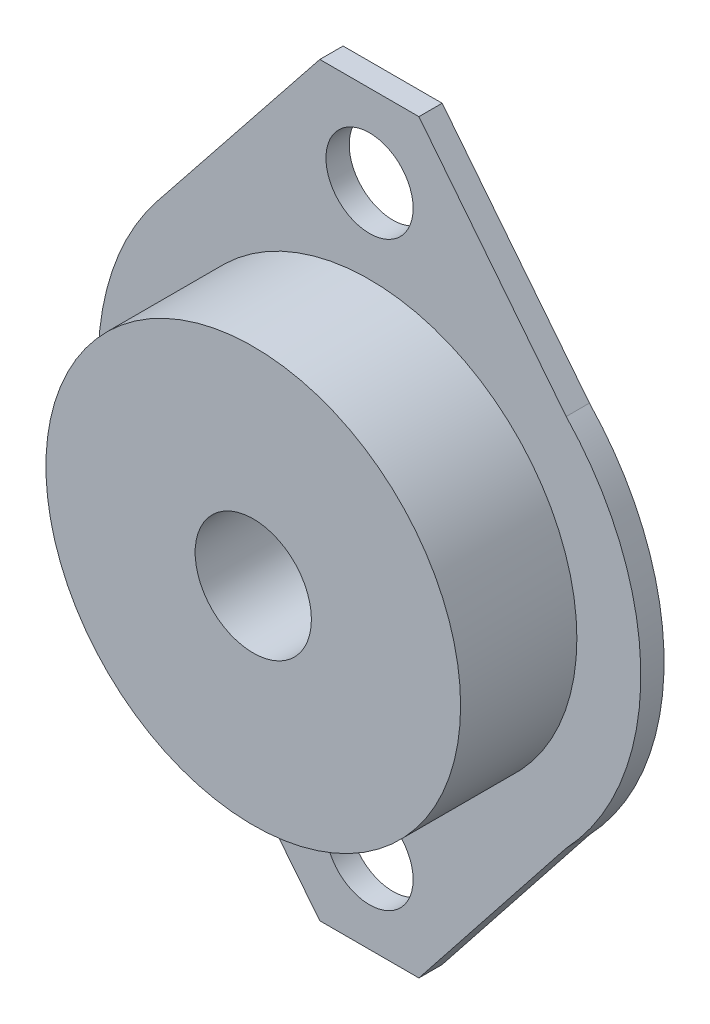
ISO-10303-21;
HEADER;
FILE_DESCRIPTION(('STEP AP214'),'2;1');
FILE_NAME('part.step','',(''),(''),'','','');
FILE_SCHEMA(('AUTOMOTIVE_DESIGN { 1 0 10303 214 1 1 1 1 }'));
ENDSEC;
DATA;
#1=APPLICATION_CONTEXT('core data for automotive mechanical design processes');
#2=APPLICATION_PROTOCOL_DEFINITION('international standard','automotive_design',2000,#1);
#3=PRODUCT_CONTEXT('',#1,'mechanical');
#4=PRODUCT('Part','Part','',(#3));
#5=PRODUCT_RELATED_PRODUCT_CATEGORY('part','',(#4));
#6=PRODUCT_DEFINITION_FORMATION('','',#4);
#7=PRODUCT_DEFINITION_CONTEXT('part definition',#1,'design');
#8=PRODUCT_DEFINITION('design','',#6,#7);
#9=PRODUCT_DEFINITION_SHAPE('','',#8);
#10=(LENGTH_UNIT() NAMED_UNIT(*) SI_UNIT(.MILLI.,.METRE.));
#11=(NAMED_UNIT(*) PLANE_ANGLE_UNIT() SI_UNIT($,.RADIAN.));
#12=(NAMED_UNIT(*) SI_UNIT($,.STERADIAN.) SOLID_ANGLE_UNIT());
#13=UNCERTAINTY_MEASURE_WITH_UNIT(LENGTH_MEASURE(1.E-05),#10,'distance_accuracy_value','');
#14=(GEOMETRIC_REPRESENTATION_CONTEXT(3) GLOBAL_UNCERTAINTY_ASSIGNED_CONTEXT((#13)) GLOBAL_UNIT_ASSIGNED_CONTEXT((#10,
#11,#12)) REPRESENTATION_CONTEXT('',''));
#15=CARTESIAN_POINT('',(0.,0.,0.));
#16=DIRECTION('',(0.,0.,1.));
#17=DIRECTION('',(1.,0.,0.));
#18=AXIS2_PLACEMENT_3D('',#15,#16,#17);
#19=CARTESIAN_POINT('',(0.,0.,1.2));
#20=DIRECTION('',(0.,0.,1.));
#21=DIRECTION('',(1.,0.,0.));
#22=AXIS2_PLACEMENT_3D('',#19,#20,#21);
#23=PLANE('',#22);
#24=DIRECTION('',(1.,0.,0.));
#25=VECTOR('',#24,1.);
#26=CARTESIAN_POINT('',(-2.56503617783972,19.2470625598085,1.2));
#27=LINE('',#26,#25);
#28=CARTESIAN_POINT('',(-2.56503617783972,19.2470625598085,1.2));
#29=VERTEX_POINT('',#28);
#30=CARTESIAN_POINT('',(2.54796509267495,19.2470625598085,1.2));
#31=VERTEX_POINT('',#30);
#32=EDGE_CURVE('E106',#29,#31,#27,.T.);
#33=ORIENTED_EDGE('',*,*,#32,.F.);
#34=DIRECTION('',(-0.623154194367181,-0.782099002711671,0.));
#35=VECTOR('',#34,1.);
#36=CARTESIAN_POINT('',(-10.9493860379634,8.72415872114053,1.2));
#37=LINE('',#36,#35);
#38=CARTESIAN_POINT('',(-10.9493860379634,8.72415872114053,1.2));
#39=VERTEX_POINT('',#38);
#40=EDGE_CURVE('E117',#29,#39,#37,.T.);
#41=ORIENTED_EDGE('',*,*,#40,.T.);
#42=CARTESIAN_POINT('',(0.,0.,1.2));
#43=DIRECTION('',(0.,0.,1.));
#44=DIRECTION('',(1.,0.,0.));
#45=AXIS2_PLACEMENT_3D('',#42,#43,#44);
#46=CIRCLE('',#45,14.);
#47=CARTESIAN_POINT('',(-10.9493860379634,-8.72415872114052,1.2));
#48=VERTEX_POINT('',#47);
#49=EDGE_CURVE('E160',#39,#48,#46,.T.);
#50=ORIENTED_EDGE('',*,*,#49,.T.);
#51=DIRECTION('',(0.62315419436718,-0.782099002711671,0.));
#52=VECTOR('',#51,1.);
#53=CARTESIAN_POINT('',(-10.9493860379634,-8.72415872114052,1.2));
#54=LINE('',#53,#52);
#55=CARTESIAN_POINT('',(-2.56503617783972,-19.2470625598085,1.2));
#56=VERTEX_POINT('',#55);
#57=EDGE_CURVE('E176',#48,#56,#54,.T.);
#58=ORIENTED_EDGE('',*,*,#57,.T.);
#59=DIRECTION('',(-1.,0.,0.));
#60=VECTOR('',#59,1.);
#61=CARTESIAN_POINT('',(-2.56503617783972,-19.2470625598085,1.2));
#62=LINE('',#61,#60);
#63=CARTESIAN_POINT('',(2.54796509267495,-19.2470625598085,1.2));
#64=VERTEX_POINT('',#63);
#65=EDGE_CURVE('E123',#64,#56,#62,.T.);
#66=ORIENTED_EDGE('',*,*,#65,.F.);
#67=DIRECTION('',(0.620607537412347,0.784121345524392,0.));
#68=VECTOR('',#67,1.);
#69=CARTESIAN_POINT('',(0.,-22.4663496234943,1.2));
#70=LINE('',#69,#68);
#71=CARTESIAN_POINT('',(10.148136547858,-9.6444452720739,1.2));
#72=VERTEX_POINT('',#71);
#73=EDGE_CURVE('E225',#64,#72,#70,.T.);
#74=ORIENTED_EDGE('',*,*,#73,.T.);
#75=CARTESIAN_POINT('',(0.,0.,1.2));
#76=DIRECTION('',(0.,0.,1.));
#77=DIRECTION('',(1.,0.,0.));
#78=AXIS2_PLACEMENT_3D('',#75,#76,#77);
#79=CIRCLE('',#78,14.);
#80=CARTESIAN_POINT('',(10.148136547858,9.6444452720739,1.2));
#81=VERTEX_POINT('',#80);
#82=EDGE_CURVE('E135',#72,#81,#79,.T.);
#83=ORIENTED_EDGE('',*,*,#82,.T.);
#84=DIRECTION('',(-0.620607537412347,0.784121345524391,0.));
#85=VECTOR('',#84,1.);
#86=CARTESIAN_POINT('',(0.,22.4663496234943,1.2));
#87=LINE('',#86,#85);
#88=EDGE_CURVE('E120',#81,#31,#87,.T.);
#89=ORIENTED_EDGE('',*,*,#88,.T.);
#90=EDGE_LOOP('',(#33,#41,#50,#58,#66,#74,#83,#89));
#91=FACE_BOUND('',#90,.T.);
#92=CARTESIAN_POINT('',(0.,-15.,1.2));
#93=DIRECTION('',(0.,0.,1.));
#94=DIRECTION('',(1.,0.,0.));
#95=AXIS2_PLACEMENT_3D('',#92,#93,#94);
#96=CIRCLE('',#95,2.25);
#97=CARTESIAN_POINT('',(2.25,-15.,1.2));
#98=VERTEX_POINT('',#97);
#99=EDGE_CURVE('E203',#98,#98,#96,.T.);
#100=ORIENTED_EDGE('',*,*,#99,.F.);
#101=EDGE_LOOP('',(#100));
#102=FACE_BOUND('',#101,.T.);
#103=CARTESIAN_POINT('',(0.,15.,1.2));
#104=DIRECTION('',(0.,0.,1.));
#105=DIRECTION('',(1.,0.,0.));
#106=AXIS2_PLACEMENT_3D('',#103,#104,#105);
#107=CIRCLE('',#106,2.25);
#108=CARTESIAN_POINT('',(2.25,15.,1.2));
#109=VERTEX_POINT('',#108);
#110=EDGE_CURVE('E211',#109,#109,#107,.T.);
#111=ORIENTED_EDGE('',*,*,#110,.F.);
#112=EDGE_LOOP('',(#111));
#113=FACE_BOUND('',#112,.T.);
#114=CARTESIAN_POINT('',(0.,0.,1.2));
#115=DIRECTION('',(0.,0.,1.));
#116=DIRECTION('',(1.,0.,0.));
#117=AXIS2_PLACEMENT_3D('',#114,#115,#116);
#118=CIRCLE('',#117,10.7);
#119=CARTESIAN_POINT('',(10.7,0.,1.2));
#120=VERTEX_POINT('',#119);
#121=EDGE_CURVE('E190',#120,#120,#118,.T.);
#122=ORIENTED_EDGE('',*,*,#121,.F.);
#123=EDGE_LOOP('',(#122));
#124=FACE_BOUND('',#123,.T.);
#125=ADVANCED_FACE('F42',(#91,#102,#113,#124),#23,.T.);
#126=CARTESIAN_POINT('',(0.,0.,0.));
#127=DIRECTION('',(0.,0.,1.));
#128=DIRECTION('',(1.,0.,0.));
#129=AXIS2_PLACEMENT_3D('',#126,#127,#128);
#130=PLANE('',#129);
#131=DIRECTION('',(-0.623154194367181,-0.782099002711671,0.));
#132=VECTOR('',#131,1.);
#133=CARTESIAN_POINT('',(-10.9493860379634,8.72415872114053,0.));
#134=LINE('',#133,#132);
#135=CARTESIAN_POINT('',(-2.56503617783973,19.2470625598085,0.));
#136=VERTEX_POINT('',#135);
#137=CARTESIAN_POINT('',(-10.9493860379634,8.72415872114053,0.));
#138=VERTEX_POINT('',#137);
#139=EDGE_CURVE('E158',#136,#138,#134,.T.);
#140=ORIENTED_EDGE('',*,*,#139,.F.);
#141=DIRECTION('',(1.,0.,0.));
#142=VECTOR('',#141,1.);
#143=CARTESIAN_POINT('',(0.,19.2470625598085,0.));
#144=LINE('',#143,#142);
#145=CARTESIAN_POINT('',(2.54796509267495,19.2470625598085,0.));
#146=VERTEX_POINT('',#145);
#147=EDGE_CURVE('E65',#136,#146,#144,.T.);
#148=ORIENTED_EDGE('',*,*,#147,.T.);
#149=DIRECTION('',(-0.620607537412347,0.784121345524391,0.));
#150=VECTOR('',#149,1.);
#151=CARTESIAN_POINT('',(0.,22.4663496234943,0.));
#152=LINE('',#151,#150);
#153=CARTESIAN_POINT('',(10.148136547858,9.6444452720739,0.));
#154=VERTEX_POINT('',#153);
#155=EDGE_CURVE('E154',#154,#146,#152,.T.);
#156=ORIENTED_EDGE('',*,*,#155,.F.);
#157=CARTESIAN_POINT('',(0.,0.,0.));
#158=DIRECTION('',(0.,0.,1.));
#159=DIRECTION('',(1.,0.,0.));
#160=AXIS2_PLACEMENT_3D('',#157,#158,#159);
#161=CIRCLE('',#160,14.);
#162=CARTESIAN_POINT('',(10.148136547858,-9.6444452720739,0.));
#163=VERTEX_POINT('',#162);
#164=EDGE_CURVE('E151',#163,#154,#161,.T.);
#165=ORIENTED_EDGE('',*,*,#164,.F.);
#166=DIRECTION('',(0.620607537412347,0.784121345524392,0.));
#167=VECTOR('',#166,1.);
#168=CARTESIAN_POINT('',(0.,-22.4663496234943,0.));
#169=LINE('',#168,#167);
#170=CARTESIAN_POINT('',(2.54796509267495,-19.2470625598085,0.));
#171=VERTEX_POINT('',#170);
#172=EDGE_CURVE('E148',#171,#163,#169,.T.);
#173=ORIENTED_EDGE('',*,*,#172,.F.);
#174=DIRECTION('',(-1.,0.,0.));
#175=VECTOR('',#174,1.);
#176=CARTESIAN_POINT('',(0.,-19.2470625598085,0.));
#177=LINE('',#176,#175);
#178=CARTESIAN_POINT('',(-2.56503617783972,-19.2470625598085,0.));
#179=VERTEX_POINT('',#178);
#180=EDGE_CURVE('E58',#171,#179,#177,.T.);
#181=ORIENTED_EDGE('',*,*,#180,.T.);
#182=DIRECTION('',(0.62315419436718,-0.782099002711671,0.));
#183=VECTOR('',#182,1.);
#184=CARTESIAN_POINT('',(-10.9493860379634,-8.72415872114052,0.));
#185=LINE('',#184,#183);
#186=CARTESIAN_POINT('',(-10.9493860379634,-8.72415872114052,0.));
#187=VERTEX_POINT('',#186);
#188=EDGE_CURVE('E143',#187,#179,#185,.T.);
#189=ORIENTED_EDGE('',*,*,#188,.F.);
#190=CARTESIAN_POINT('',(0.,0.,0.));
#191=DIRECTION('',(0.,0.,1.));
#192=DIRECTION('',(1.,0.,0.));
#193=AXIS2_PLACEMENT_3D('',#190,#191,#192);
#194=CIRCLE('',#193,14.);
#195=EDGE_CURVE('E139',#138,#187,#194,.T.);
#196=ORIENTED_EDGE('',*,*,#195,.F.);
#197=EDGE_LOOP('',(#140,#148,#156,#165,#173,#181,#189,#196));
#198=FACE_BOUND('',#197,.T.);
#199=CARTESIAN_POINT('',(0.,0.,0.));
#200=DIRECTION('',(0.,0.,1.));
#201=DIRECTION('',(1.,0.,0.));
#202=AXIS2_PLACEMENT_3D('',#199,#200,#201);
#203=CIRCLE('',#202,3.);
#204=CARTESIAN_POINT('',(3.,0.,0.));
#205=VERTEX_POINT('',#204);
#206=EDGE_CURVE('E144',#205,#205,#203,.T.);
#207=ORIENTED_EDGE('',*,*,#206,.T.);
#208=EDGE_LOOP('',(#207));
#209=FACE_BOUND('',#208,.T.);
#210=CARTESIAN_POINT('',(0.,15.,0.));
#211=DIRECTION('',(0.,0.,1.));
#212=DIRECTION('',(1.,0.,0.));
#213=AXIS2_PLACEMENT_3D('',#210,#211,#212);
#214=CIRCLE('',#213,2.25);
#215=CARTESIAN_POINT('',(2.25,15.,0.));
#216=VERTEX_POINT('',#215);
#217=EDGE_CURVE('E207',#216,#216,#214,.T.);
#218=ORIENTED_EDGE('',*,*,#217,.T.);
#219=EDGE_LOOP('',(#218));
#220=FACE_BOUND('',#219,.T.);
#221=CARTESIAN_POINT('',(0.,-15.,0.));
#222=DIRECTION('',(0.,0.,1.));
#223=DIRECTION('',(1.,0.,0.));
#224=AXIS2_PLACEMENT_3D('',#221,#222,#223);
#225=CIRCLE('',#224,2.25);
#226=CARTESIAN_POINT('',(2.25,-15.,0.));
#227=VERTEX_POINT('',#226);
#228=EDGE_CURVE('E199',#227,#227,#225,.T.);
#229=ORIENTED_EDGE('',*,*,#228,.T.);
#230=EDGE_LOOP('',(#229));
#231=FACE_BOUND('',#230,.T.);
#232=ADVANCED_FACE('F180',(#198,#209,#220,#231),#130,.F.);
#233=CARTESIAN_POINT('',(0.,0.,1.2));
#234=DIRECTION('',(0.,0.,-1.));
#235=DIRECTION('',(-1.,0.,0.));
#236=AXIS2_PLACEMENT_3D('',#233,#234,#235);
#237=CYLINDRICAL_SURFACE('',#236,14.);
#238=ORIENTED_EDGE('',*,*,#195,.T.);
#239=DIRECTION('',(0.,0.,-1.));
#240=VECTOR('',#239,1.);
#241=CARTESIAN_POINT('',(-10.9493860379634,-8.72415872114052,1.2));
#242=LINE('',#241,#240);
#243=EDGE_CURVE('E112',#48,#187,#242,.T.);
#244=ORIENTED_EDGE('',*,*,#243,.F.);
#245=ORIENTED_EDGE('',*,*,#49,.F.);
#246=DIRECTION('',(0.,0.,-1.));
#247=VECTOR('',#246,1.);
#248=CARTESIAN_POINT('',(-10.9493860379634,8.72415872114053,1.2));
#249=LINE('',#248,#247);
#250=EDGE_CURVE('E127',#39,#138,#249,.T.);
#251=ORIENTED_EDGE('',*,*,#250,.T.);
#252=EDGE_LOOP('',(#238,#244,#245,#251));
#253=FACE_BOUND('',#252,.T.);
#254=ADVANCED_FACE('F44',(#253),#237,.T.);
#255=CARTESIAN_POINT('',(-10.9493860379634,-8.72415872114052,1.2));
#256=DIRECTION('',(0.782099002711671,0.62315419436718,0.));
#257=DIRECTION('',(-0.62315419436718,0.782099002711671,0.));
#258=AXIS2_PLACEMENT_3D('',#255,#256,#257);
#259=PLANE('',#258);
#260=ORIENTED_EDGE('',*,*,#188,.T.);
#261=DIRECTION('',(0.,0.,1.));
#262=VECTOR('',#261,1.);
#263=CARTESIAN_POINT('',(-2.56503617783972,-19.2470625598085,-4.8));
#264=LINE('',#263,#262);
#265=EDGE_CURVE('E241',#179,#56,#264,.T.);
#266=ORIENTED_EDGE('',*,*,#265,.T.);
#267=ORIENTED_EDGE('',*,*,#57,.F.);
#268=ORIENTED_EDGE('',*,*,#243,.T.);
#269=EDGE_LOOP('',(#260,#266,#267,#268));
#270=FACE_BOUND('',#269,.T.);
#271=ADVANCED_FACE('F173',(#270),#259,.F.);
#272=CARTESIAN_POINT('',(0.,-22.4663496234943,1.2));
#273=DIRECTION('',(-0.784121345524392,0.620607537412347,0.));
#274=DIRECTION('',(-0.620607537412347,-0.784121345524392,0.));
#275=AXIS2_PLACEMENT_3D('',#272,#273,#274);
#276=PLANE('',#275);
#277=ORIENTED_EDGE('',*,*,#73,.F.);
#278=DIRECTION('',(0.,0.,-1.));
#279=VECTOR('',#278,1.);
#280=CARTESIAN_POINT('',(2.54796509267495,-19.2470625598085,1.2));
#281=LINE('',#280,#279);
#282=EDGE_CURVE('E11',#64,#171,#281,.T.);
#283=ORIENTED_EDGE('',*,*,#282,.T.);
#284=ORIENTED_EDGE('',*,*,#172,.T.);
#285=DIRECTION('',(0.,0.,-1.));
#286=VECTOR('',#285,1.);
#287=CARTESIAN_POINT('',(10.148136547858,-9.6444452720739,1.2));
#288=LINE('',#287,#286);
#289=EDGE_CURVE('E165',#72,#163,#288,.T.);
#290=ORIENTED_EDGE('',*,*,#289,.F.);
#291=EDGE_LOOP('',(#277,#283,#284,#290));
#292=FACE_BOUND('',#291,.T.);
#293=ADVANCED_FACE('F246',(#292),#276,.F.);
#294=CARTESIAN_POINT('',(0.,0.,1.2));
#295=DIRECTION('',(0.,0.,-1.));
#296=DIRECTION('',(-1.,0.,0.));
#297=AXIS2_PLACEMENT_3D('',#294,#295,#296);
#298=CYLINDRICAL_SURFACE('',#297,14.);
#299=ORIENTED_EDGE('',*,*,#164,.T.);
#300=DIRECTION('',(0.,0.,-1.));
#301=VECTOR('',#300,1.);
#302=CARTESIAN_POINT('',(10.148136547858,9.6444452720739,1.2));
#303=LINE('',#302,#301);
#304=EDGE_CURVE('E133',#81,#154,#303,.T.);
#305=ORIENTED_EDGE('',*,*,#304,.F.);
#306=ORIENTED_EDGE('',*,*,#82,.F.);
#307=ORIENTED_EDGE('',*,*,#289,.T.);
#308=EDGE_LOOP('',(#299,#305,#306,#307));
#309=FACE_BOUND('',#308,.T.);
#310=ADVANCED_FACE('F234',(#309),#298,.T.);
#311=CARTESIAN_POINT('',(0.,22.4663496234943,1.2));
#312=DIRECTION('',(-0.784121345524391,-0.620607537412347,0.));
#313=DIRECTION('',(0.620607537412347,-0.784121345524391,0.));
#314=AXIS2_PLACEMENT_3D('',#311,#312,#313);
#315=PLANE('',#314);
#316=ORIENTED_EDGE('',*,*,#155,.T.);
#317=DIRECTION('',(0.,0.,1.));
#318=VECTOR('',#317,1.);
#319=CARTESIAN_POINT('',(2.54796509267495,19.2470625598085,-4.8));
#320=LINE('',#319,#318);
#321=EDGE_CURVE('E122',#146,#31,#320,.T.);
#322=ORIENTED_EDGE('',*,*,#321,.T.);
#323=ORIENTED_EDGE('',*,*,#88,.F.);
#324=ORIENTED_EDGE('',*,*,#304,.T.);
#325=EDGE_LOOP('',(#316,#322,#323,#324));
#326=FACE_BOUND('',#325,.T.);
#327=ADVANCED_FACE('F237',(#326),#315,.F.);
#328=CARTESIAN_POINT('',(-10.9493860379634,8.72415872114053,1.2));
#329=DIRECTION('',(0.782099002711671,-0.623154194367181,0.));
#330=DIRECTION('',(0.623154194367181,0.782099002711671,0.));
#331=AXIS2_PLACEMENT_3D('',#328,#329,#330);
#332=PLANE('',#331);
#333=ORIENTED_EDGE('',*,*,#40,.F.);
#334=DIRECTION('',(0.,0.,-1.));
#335=VECTOR('',#334,1.);
#336=CARTESIAN_POINT('',(-2.56503617783973,19.2470625598085,1.2));
#337=LINE('',#336,#335);
#338=EDGE_CURVE('E51',#29,#136,#337,.T.);
#339=ORIENTED_EDGE('',*,*,#338,.T.);
#340=ORIENTED_EDGE('',*,*,#139,.T.);
#341=ORIENTED_EDGE('',*,*,#250,.F.);
#342=EDGE_LOOP('',(#333,#339,#340,#341));
#343=FACE_BOUND('',#342,.T.);
#344=ADVANCED_FACE('F125',(#343),#332,.F.);
#345=CARTESIAN_POINT('',(0.,0.,1.2));
#346=DIRECTION('',(0.,0.,-1.));
#347=DIRECTION('',(-1.,0.,0.));
#348=AXIS2_PLACEMENT_3D('',#345,#346,#347);
#349=CYLINDRICAL_SURFACE('',#348,3.);
#350=ORIENTED_EDGE('',*,*,#206,.F.);
#351=EDGE_LOOP('',(#350));
#352=FACE_BOUND('',#351,.T.);
#353=CARTESIAN_POINT('',(0.,0.,7.2));
#354=DIRECTION('',(0.,0.,1.));
#355=DIRECTION('',(1.,0.,0.));
#356=AXIS2_PLACEMENT_3D('',#353,#354,#355);
#357=CIRCLE('',#356,3.);
#358=CARTESIAN_POINT('',(3.,0.,7.2));
#359=VERTEX_POINT('',#358);
#360=EDGE_CURVE('E185',#359,#359,#357,.T.);
#361=ORIENTED_EDGE('',*,*,#360,.T.);
#362=EDGE_LOOP('',(#361));
#363=FACE_BOUND('',#362,.T.);
#364=ADVANCED_FACE('F261',(#352,#363),#349,.F.);
#365=CARTESIAN_POINT('',(0.,15.,1.2));
#366=DIRECTION('',(0.,0.,-1.));
#367=DIRECTION('',(-1.,0.,0.));
#368=AXIS2_PLACEMENT_3D('',#365,#366,#367);
#369=CYLINDRICAL_SURFACE('',#368,2.25);
#370=ORIENTED_EDGE('',*,*,#110,.T.);
#371=EDGE_LOOP('',(#370));
#372=FACE_BOUND('',#371,.T.);
#373=ORIENTED_EDGE('',*,*,#217,.F.);
#374=EDGE_LOOP('',(#373));
#375=FACE_BOUND('',#374,.T.);
#376=ADVANCED_FACE('F282',(#372,#375),#369,.F.);
#377=CARTESIAN_POINT('',(0.,-15.,1.2));
#378=DIRECTION('',(0.,0.,-1.));
#379=DIRECTION('',(-1.,0.,0.));
#380=AXIS2_PLACEMENT_3D('',#377,#378,#379);
#381=CYLINDRICAL_SURFACE('',#380,2.25);
#382=ORIENTED_EDGE('',*,*,#99,.T.);
#383=EDGE_LOOP('',(#382));
#384=FACE_BOUND('',#383,.T.);
#385=ORIENTED_EDGE('',*,*,#228,.F.);
#386=EDGE_LOOP('',(#385));
#387=FACE_BOUND('',#386,.T.);
#388=ADVANCED_FACE('F291',(#384,#387),#381,.F.);
#389=CARTESIAN_POINT('',(0.,0.,7.2));
#390=DIRECTION('',(0.,0.,1.));
#391=DIRECTION('',(1.,0.,0.));
#392=AXIS2_PLACEMENT_3D('',#389,#390,#391);
#393=PLANE('',#392);
#394=CARTESIAN_POINT('',(0.,0.,7.2));
#395=DIRECTION('',(0.,0.,1.));
#396=DIRECTION('',(1.,0.,0.));
#397=AXIS2_PLACEMENT_3D('',#394,#395,#396);
#398=CIRCLE('',#397,10.7);
#399=CARTESIAN_POINT('',(10.7,0.,7.2));
#400=VERTEX_POINT('',#399);
#401=EDGE_CURVE('E195',#400,#400,#398,.T.);
#402=ORIENTED_EDGE('',*,*,#401,.T.);
#403=EDGE_LOOP('',(#402));
#404=FACE_BOUND('',#403,.T.);
#405=ORIENTED_EDGE('',*,*,#360,.F.);
#406=EDGE_LOOP('',(#405));
#407=FACE_BOUND('',#406,.T.);
#408=ADVANCED_FACE('F297',(#404,#407),#393,.T.);
#409=CARTESIAN_POINT('',(0.,0.,7.2));
#410=DIRECTION('',(0.,0.,-1.));
#411=DIRECTION('',(-1.,0.,0.));
#412=AXIS2_PLACEMENT_3D('',#409,#410,#411);
#413=CYLINDRICAL_SURFACE('',#412,10.7);
#414=ORIENTED_EDGE('',*,*,#401,.F.);
#415=EDGE_LOOP('',(#414));
#416=FACE_BOUND('',#415,.T.);
#417=ORIENTED_EDGE('',*,*,#121,.T.);
#418=EDGE_LOOP('',(#417));
#419=FACE_BOUND('',#418,.T.);
#420=ADVANCED_FACE('F304',(#416,#419),#413,.T.);
#421=CARTESIAN_POINT('',(-2.56503617783972,19.2470625598085,-4.8));
#422=DIRECTION('',(0.,-1.,0.));
#423=DIRECTION('',(0.,0.,-1.));
#424=AXIS2_PLACEMENT_3D('',#421,#422,#423);
#425=PLANE('',#424);
#426=ORIENTED_EDGE('',*,*,#338,.F.);
#427=ORIENTED_EDGE('',*,*,#32,.T.);
#428=ORIENTED_EDGE('',*,*,#321,.F.);
#429=ORIENTED_EDGE('',*,*,#147,.F.);
#430=EDGE_LOOP('',(#426,#427,#428,#429));
#431=FACE_BOUND('',#430,.T.);
#432=ADVANCED_FACE('F105',(#431),#425,.F.);
#433=CARTESIAN_POINT('',(-2.56503617783972,-19.2470625598085,-4.8));
#434=DIRECTION('',(0.,1.,0.));
#435=DIRECTION('',(0.,0.,1.));
#436=AXIS2_PLACEMENT_3D('',#433,#434,#435);
#437=PLANE('',#436);
#438=ORIENTED_EDGE('',*,*,#282,.F.);
#439=ORIENTED_EDGE('',*,*,#65,.T.);
#440=ORIENTED_EDGE('',*,*,#265,.F.);
#441=ORIENTED_EDGE('',*,*,#180,.F.);
#442=EDGE_LOOP('',(#438,#439,#440,#441));
#443=FACE_BOUND('',#442,.T.);
#444=ADVANCED_FACE('F244',(#443),#437,.F.);
#445=CLOSED_SHELL('',(#125,#232,#254,#271,#293,#310,#327,#344,#364,#376,#388,#408,#420,#432,#444));
#446=MANIFOLD_SOLID_BREP('B2',#445);
#447=ADVANCED_BREP_SHAPE_REPRESENTATION('',(#18,#446),#14);
#448=SHAPE_DEFINITION_REPRESENTATION(#9,#447);
ENDSEC;
END-ISO-10303-21;
